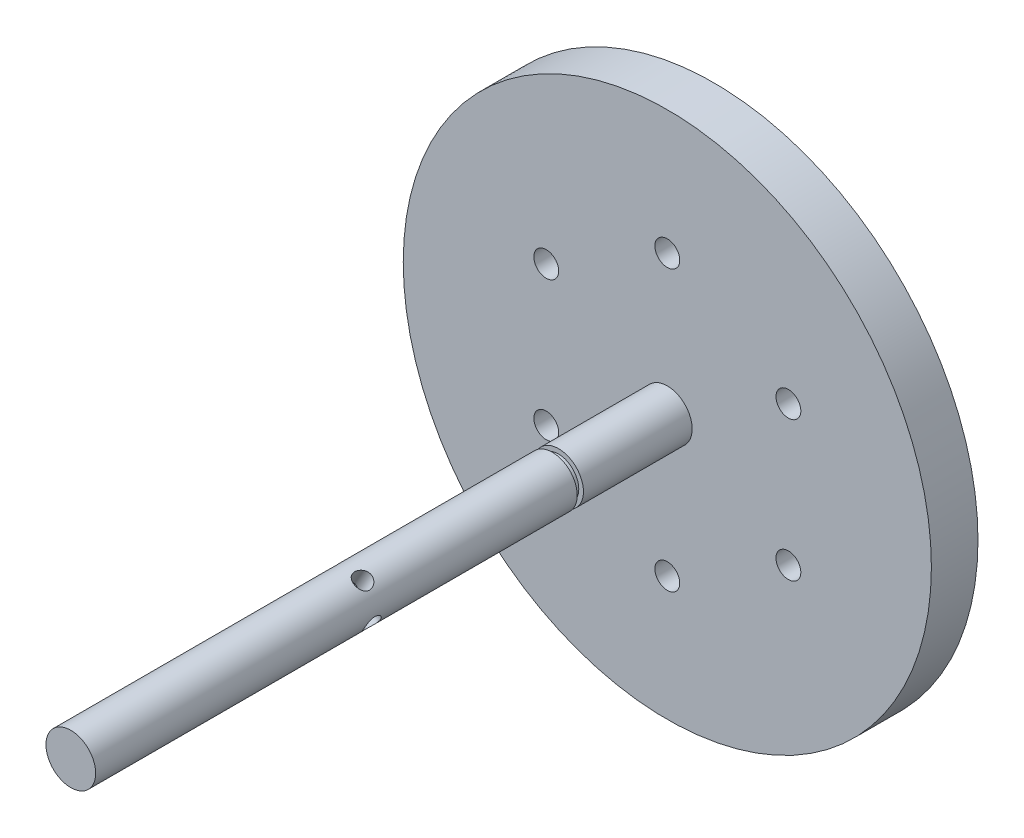
ISO-10303-21;
HEADER;
FILE_DESCRIPTION(('STEP AP214'),'2;1');
FILE_NAME('part.step','',(''),(''),'','','');
FILE_SCHEMA(('AUTOMOTIVE_DESIGN { 1 0 10303 214 1 1 1 1 }'));
ENDSEC;
DATA;
#1=APPLICATION_CONTEXT('core data for automotive mechanical design processes');
#2=APPLICATION_PROTOCOL_DEFINITION('international standard','automotive_design',2000,#1);
#3=PRODUCT_CONTEXT('',#1,'mechanical');
#4=PRODUCT('Part','Part','',(#3));
#5=PRODUCT_RELATED_PRODUCT_CATEGORY('part','',(#4));
#6=PRODUCT_DEFINITION_FORMATION('','',#4);
#7=PRODUCT_DEFINITION_CONTEXT('part definition',#1,'design');
#8=PRODUCT_DEFINITION('design','',#6,#7);
#9=PRODUCT_DEFINITION_SHAPE('','',#8);
#10=(LENGTH_UNIT() NAMED_UNIT(*) SI_UNIT(.MILLI.,.METRE.));
#11=(NAMED_UNIT(*) PLANE_ANGLE_UNIT() SI_UNIT($,.RADIAN.));
#12=(NAMED_UNIT(*) SI_UNIT($,.STERADIAN.) SOLID_ANGLE_UNIT());
#13=UNCERTAINTY_MEASURE_WITH_UNIT(LENGTH_MEASURE(1.E-05),#10,'distance_accuracy_value','');
#14=(GEOMETRIC_REPRESENTATION_CONTEXT(3) GLOBAL_UNCERTAINTY_ASSIGNED_CONTEXT((#13)) GLOBAL_UNIT_ASSIGNED_CONTEXT((#10,
#11,#12)) REPRESENTATION_CONTEXT('',''));
#15=CARTESIAN_POINT('',(0.,0.,0.));
#16=DIRECTION('',(0.,0.,1.));
#17=DIRECTION('',(1.,0.,0.));
#18=AXIS2_PLACEMENT_3D('',#15,#16,#17);
#19=CARTESIAN_POINT('',(-65.2404221471998,87.666575288732,125.));
#20=DIRECTION('',(0.866025403784436,-0.500000000000004,0.));
#21=DIRECTION('',(0.500000000000004,0.866025403784436,0.));
#22=AXIS2_PLACEMENT_3D('',#19,#20,#21);
#23=CYLINDRICAL_SURFACE('',#22,2.75);
#24=CARTESIAN_POINT('',(7.88100683983674,48.6253250600789,125.));
#25=CARTESIAN_POINT('',(7.88100648561913,48.625327263558,125.149484403382));
#26=CARTESIAN_POINT('',(7.87879816708141,48.6124787382199,125.298956836047));
#27=CARTESIAN_POINT('',(7.86970576134224,48.5618135604455,125.5934543314));
#28=CARTESIAN_POINT('',(7.86282114449435,48.5239940797649,125.738478888367));
#29=CARTESIAN_POINT('',(7.84367768935151,48.4254494960907,126.019762764748));
#30=CARTESIAN_POINT('',(7.83142992290832,48.3647716185397,126.156039482397));
#31=CARTESIAN_POINT('',(7.80052945349691,48.2232134268387,126.416862164568));
#32=CARTESIAN_POINT('',(7.78187520109731,48.1423282267669,126.541405281983));
#33=CARTESIAN_POINT('',(7.73613016940697,47.9600417326456,126.780411557589));
#34=CARTESIAN_POINT('',(7.70874700176705,47.8579802120958,126.894315348241));
#35=CARTESIAN_POINT('',(7.64453145820999,47.6390384949065,127.103771856066));
#36=CARTESIAN_POINT('',(7.60769745645135,47.5221557503007,127.199321410781));
#37=CARTESIAN_POINT('',(7.52240050554838,47.2739853759718,127.371932243864));
#38=CARTESIAN_POINT('',(7.47364132088044,47.142386454217,127.448402178024));
#39=CARTESIAN_POINT('',(7.36462496737484,46.872143339736,127.576759918411));
#40=CARTESIAN_POINT('',(7.30437111434425,46.7335011871754,127.628654798679));
#41=CARTESIAN_POINT('',(7.17528716552479,46.4591844592815,127.704477000997));
#42=CARTESIAN_POINT('',(7.10685451658792,46.3235885670117,127.729363701905));
#43=CARTESIAN_POINT('',(6.96125516040155,46.0548440003846,127.753519214448));
#44=CARTESIAN_POINT('',(6.88409084991422,45.9216946660775,127.752795039117));
#45=CARTESIAN_POINT('',(6.72681875857952,45.6674089670488,127.726345980131));
#46=CARTESIAN_POINT('',(6.64696768280106,45.5460032147195,127.701664302944));
#47=CARTESIAN_POINT('',(6.48424211619768,45.3122612160059,127.629733094545));
#48=CARTESIAN_POINT('',(6.40136741777984,45.1999255940576,127.582482011083));
#49=CARTESIAN_POINT('',(6.23459099626998,44.9851592873279,127.466175083569));
#50=CARTESIAN_POINT('',(6.15069057415261,44.8828834518391,127.396832440946));
#51=CARTESIAN_POINT('',(5.98635224571477,44.6915618097227,127.238550907588));
#52=CARTESIAN_POINT('',(5.90591535187251,44.6025198532973,127.149606332573));
#53=CARTESIAN_POINT('',(5.74807396823709,44.4346080120609,126.949442648805));
#54=CARTESIAN_POINT('',(5.67102074066502,44.3564668371762,126.837333929879));
#55=CARTESIAN_POINT('',(5.52840590609079,44.2166857063728,126.596677540203));
#56=CARTESIAN_POINT('',(5.46284631248555,44.1550486405656,126.468126996064));
#57=CARTESIAN_POINT('',(5.34608381507881,44.0480436334953,126.195531828109));
#58=CARTESIAN_POINT('',(5.29512752195165,44.0029519107676,126.051272124708));
#59=CARTESIAN_POINT('',(5.21255366601847,43.9310364856177,125.753002904486));
#60=CARTESIAN_POINT('',(5.18092737721183,43.9042045396984,125.59899782165));
#61=CARTESIAN_POINT('',(5.14046193439289,43.8700470626879,125.293465012907));
#62=CARTESIAN_POINT('',(5.13060931710043,43.8618534324852,125.142168582695));
#63=CARTESIAN_POINT('',(5.13142881389251,43.8625376866459,124.83968732206));
#64=CARTESIAN_POINT('',(5.14209688984122,43.8714122122761,124.688502475536));
#65=CARTESIAN_POINT('',(5.182352805878,43.9054236493333,124.396428820769));
#66=CARTESIAN_POINT('',(5.21121936607281,43.9299409998188,124.255366348858));
#67=CARTESIAN_POINT('',(5.28527268768449,43.9943124565737,123.981264334783));
#68=CARTESIAN_POINT('',(5.33046245585385,44.0341693884992,123.848226275996));
#69=CARTESIAN_POINT('',(5.43623589954173,44.1303665035653,123.589049192119));
#70=CARTESIAN_POINT('',(5.49728097372902,44.1872101449053,123.463286021029));
#71=CARTESIAN_POINT('',(5.63063559186262,44.3162915664434,123.226473898833));
#72=CARTESIAN_POINT('',(5.7029486555699,44.3885341593868,123.115429565548));
#73=CARTESIAN_POINT('',(5.85931356159089,44.5518943126784,122.905269956371));
#74=CARTESIAN_POINT('',(5.94377894621135,44.6437944312336,122.807067850351));
#75=CARTESIAN_POINT('',(6.11723513995591,44.8427884641403,122.632428643783));
#76=CARTESIAN_POINT('',(6.20622582091651,44.9498819483454,122.555990927239));
#77=CARTESIAN_POINT('',(6.38412500492079,45.1767666886991,122.427717385063));
#78=CARTESIAN_POINT('',(6.47303072486521,45.2964768805308,122.375734969586));
#79=CARTESIAN_POINT('',(6.64742376967013,45.546357952591,122.297652835897));
#80=CARTESIAN_POINT('',(6.73291240374444,45.6765247678323,122.271543111874));
#81=CARTESIAN_POINT('',(6.89300771432307,45.9369169428959,122.246892422876));
#82=CARTESIAN_POINT('',(6.9679442086175,46.0668170541246,122.247044218696));
#83=CARTESIAN_POINT('',(7.10947411599583,46.3288227942804,122.271654470638));
#84=CARTESIAN_POINT('',(7.17606827916538,46.4609282237083,122.296110739699));
#85=CARTESIAN_POINT('',(7.29846921326715,46.7208777263663,122.367753476998));
#86=CARTESIAN_POINT('',(7.35444677324784,46.8487558020766,122.414527954583));
#87=CARTESIAN_POINT('',(7.45665100750471,47.0988576819346,122.529091815702));
#88=CARTESIAN_POINT('',(7.50287588213125,47.2210804392714,122.596885072112));
#89=CARTESIAN_POINT('',(7.58744054510109,47.4608020453979,122.754547973205));
#90=CARTESIAN_POINT('',(7.62540983574835,47.5779398276893,122.845164720465));
#91=CARTESIAN_POINT('',(7.6920076517064,47.798563494324,123.04465482906));
#92=CARTESIAN_POINT('',(7.72063309341666,47.902044865163,123.153534199406));
#93=CARTESIAN_POINT('',(7.77075846327996,48.0958549037186,123.391966842931));
#94=CARTESIAN_POINT('',(7.79190515615227,48.1854406612915,123.522200533446));
#95=CARTESIAN_POINT('',(7.82674903315412,48.3421478839134,123.796467322612));
#96=CARTESIAN_POINT('',(7.84044756488314,48.4092734118569,123.940497919433));
#97=CARTESIAN_POINT('',(7.86142032404019,48.5164225362567,124.23483935916));
#98=CARTESIAN_POINT('',(7.86884144468728,48.5570604003382,124.384915139286));
#99=CARTESIAN_POINT('',(7.87863385833534,48.6115050585716,124.689999592243));
#100=CARTESIAN_POINT('',(7.88100720710933,48.6253227753888,124.845006230801));
#101=CARTESIAN_POINT('',(7.88100683983674,48.6253250600789,125.));
#102=B_SPLINE_CURVE_WITH_KNOTS('',3,(#24,#25,#26,#27,#28,#29,#30,#31,#32,#33,#34,#35,#36,#37,
#38,#39,#40,#41,#42,#43,#44,#45,#46,#47,#48,#49,#50,#51,#52,#53,#54,#55,#56,#57,#58,#59,#60,#61,
#62,#63,#64,#65,#66,#67,#68,#69,#70,#71,#72,#73,#74,#75,#76,#77,#78,#79,#80,#81,#82,#83,#84,#85,
#86,#87,#88,#89,#90,#91,#92,#93,#94,#95,#96,#97,#98,#99,#100,#101),.UNSPECIFIED.,.T.,.F.,(4,2,2,
2,2,2,2,2,2,2,2,2,2,2,2,2,2,2,2,2,2,2,2,2,2,2,2,2,2,2,2,2,2,2,2,2,2,2,4),(0.,0.447878471310559,
0.895807678647803,1.34281649487077,1.78993349798677,2.25396053342138,2.71806744972459,
3.19514524544689,3.67208562855214,4.13146570087796,4.59071998201178,5.03083403108972,
5.4709783541635,5.91708705064722,6.36332528288108,6.83181694416434,7.30039059163359,
7.77646484543835,8.25232402953415,8.70552141007255,9.15862961792376,9.59482010596747,
10.0310909817763,10.481850659322,10.9327514231396,11.4069565972228,11.8811483485421,
12.3524602995581,12.8235899076946,13.2712748436076,13.7189194978019,14.1586028223481,
14.5983672102306,15.0550012048507,15.5117857430623,15.9879212958433,16.4639706724929,
16.9285452993276,17.3929306856361),.UNSPECIFIED.);
#103=CARTESIAN_POINT('',(7.88100683983674,48.6253250600789,125.));
#104=VERTEX_POINT('',#103);
#105=EDGE_CURVE('E74',#104,#104,#102,.T.);
#106=ORIENTED_EDGE('',*,*,#105,.T.);
#107=EDGE_LOOP('',(#106));
#108=FACE_BOUND('',#107,.T.);
#109=CARTESIAN_POINT('',(1.94289029309402E-13,50.0000000000009,125.));
#110=DIRECTION('',(0.258819045102522,-0.965925826289068,0.));
#111=DIRECTION('',(0.965925826289068,0.258819045102522,0.));
#112=AXIS2_PLACEMENT_3D('',#109,#110,#111);
#113=ELLIPSE('',#112,3.88908729652599,2.75);
#114=CARTESIAN_POINT('',(1.94289029309402E-13,50.0000000000009,127.75));
#115=VERTEX_POINT('',#114);
#116=CARTESIAN_POINT('',(1.94289029309402E-13,50.0000000000009,122.25));
#117=VERTEX_POINT('',#116);
#118=EDGE_CURVE('E48',#115,#117,#113,.F.);
#119=ORIENTED_EDGE('',*,*,#118,.T.);
#120=CARTESIAN_POINT('',(1.94289029309402E-13,50.0000000000009,125.));
#121=DIRECTION('',(0.965925826289068,0.258819045102522,0.));
#122=DIRECTION('',(0.258819045102522,-0.965925826289068,0.));
#123=AXIS2_PLACEMENT_3D('',#120,#121,#122);
#124=ELLIPSE('',#123,3.88908729652603,2.75);
#125=EDGE_CURVE('E11',#117,#115,#124,.F.);
#126=ORIENTED_EDGE('',*,*,#125,.T.);
#127=EDGE_LOOP('',(#119,#126));
#128=FACE_BOUND('',#127,.T.);
#129=ADVANCED_FACE('F35',(#108,#128),#23,.F.);
#130=CARTESIAN_POINT('',(0.,50.,8.00000000000009));
#131=DIRECTION('',(0.,0.,1.));
#132=DIRECTION('',(1.,0.,0.));
#133=AXIS2_PLACEMENT_3D('',#130,#131,#132);
#134=CYLINDRICAL_SURFACE('',#133,85.0000000000001);
#135=CARTESIAN_POINT('',(0.,50.,8.00000000000008));
#136=DIRECTION('',(0.,0.,1.));
#137=DIRECTION('',(1.,0.,0.));
#138=AXIS2_PLACEMENT_3D('',#135,#136,#137);
#139=CIRCLE('',#138,85.0000000000001);
#140=CARTESIAN_POINT('',(85.0000000000001,50.,8.00000000000007));
#141=VERTEX_POINT('',#140);
#142=EDGE_CURVE('E61',#141,#141,#139,.T.);
#143=ORIENTED_EDGE('',*,*,#142,.T.);
#144=EDGE_LOOP('',(#143));
#145=FACE_BOUND('',#144,.T.);
#146=CARTESIAN_POINT('',(0.,50.,23.0000000000001));
#147=DIRECTION('',(0.,0.,1.));
#148=DIRECTION('',(1.,0.,0.));
#149=AXIS2_PLACEMENT_3D('',#146,#147,#148);
#150=CIRCLE('',#149,85.0000000000001);
#151=CARTESIAN_POINT('',(85.0000000000001,50.,23.0000000000001));
#152=VERTEX_POINT('',#151);
#153=EDGE_CURVE('E192',#152,#152,#150,.T.);
#154=ORIENTED_EDGE('',*,*,#153,.F.);
#155=EDGE_LOOP('',(#154));
#156=FACE_BOUND('',#155,.T.);
#157=ADVANCED_FACE('F37',(#145,#156),#134,.T.);
#158=CARTESIAN_POINT('',(85.0000000000001,50.,8.00000000000007));
#159=DIRECTION('',(0.,0.,-1.));
#160=DIRECTION('',(-1.,0.,0.));
#161=AXIS2_PLACEMENT_3D('',#158,#159,#160);
#162=PLANE('',#161);
#163=CARTESIAN_POINT('',(0.,50.,8.00000000000008));
#164=DIRECTION('',(0.,0.,-1.));
#165=DIRECTION('',(-1.,0.,0.));
#166=AXIS2_PLACEMENT_3D('',#163,#164,#165);
#167=CIRCLE('',#166,4.);
#168=CARTESIAN_POINT('',(-3.99999999999997,50.,8.00000000000008));
#169=VERTEX_POINT('',#168);
#170=EDGE_CURVE('E255',#169,#169,#167,.T.);
#171=ORIENTED_EDGE('',*,*,#170,.F.);
#172=EDGE_LOOP('',(#171));
#173=FACE_BOUND('',#172,.T.);
#174=CARTESIAN_POINT('',(0.,95.,8.00000000000008));
#175=DIRECTION('',(0.,0.,-1.));
#176=DIRECTION('',(-1.,0.,0.));
#177=AXIS2_PLACEMENT_3D('',#174,#175,#176);
#178=CIRCLE('',#177,4.);
#179=CARTESIAN_POINT('',(-3.99999999999998,95.,8.00000000000008));
#180=VERTEX_POINT('',#179);
#181=EDGE_CURVE('E73',#180,#180,#178,.T.);
#182=ORIENTED_EDGE('',*,*,#181,.F.);
#183=EDGE_LOOP('',(#182));
#184=FACE_BOUND('',#183,.T.);
#185=CARTESIAN_POINT('',(38.9711431702998,72.5,8.00000000000008));
#186=DIRECTION('',(0.,0.,-1.));
#187=DIRECTION('',(-1.,0.,0.));
#188=AXIS2_PLACEMENT_3D('',#185,#186,#187);
#189=CIRCLE('',#188,4.);
#190=CARTESIAN_POINT('',(34.9711431702998,72.5,8.00000000000008));
#191=VERTEX_POINT('',#190);
#192=EDGE_CURVE('E166',#191,#191,#189,.T.);
#193=ORIENTED_EDGE('',*,*,#192,.F.);
#194=EDGE_LOOP('',(#193));
#195=FACE_BOUND('',#194,.T.);
#196=CARTESIAN_POINT('',(38.9711431702997,27.4999999999999,8.00000000000008));
#197=DIRECTION('',(0.,0.,-1.));
#198=DIRECTION('',(-1.,0.,0.));
#199=AXIS2_PLACEMENT_3D('',#196,#197,#198);
#200=CIRCLE('',#199,4.);
#201=CARTESIAN_POINT('',(34.9711431702997,27.4999999999999,8.00000000000008));
#202=VERTEX_POINT('',#201);
#203=EDGE_CURVE('E170',#202,#202,#200,.T.);
#204=ORIENTED_EDGE('',*,*,#203,.F.);
#205=EDGE_LOOP('',(#204));
#206=FACE_BOUND('',#205,.T.);
#207=CARTESIAN_POINT('',(0.,5.,8.00000000000008));
#208=DIRECTION('',(0.,0.,-1.));
#209=DIRECTION('',(-1.,0.,0.));
#210=AXIS2_PLACEMENT_3D('',#207,#208,#209);
#211=CIRCLE('',#210,4.);
#212=CARTESIAN_POINT('',(-4.00000000000001,5.,8.00000000000008));
#213=VERTEX_POINT('',#212);
#214=EDGE_CURVE('E174',#213,#213,#211,.T.);
#215=ORIENTED_EDGE('',*,*,#214,.F.);
#216=EDGE_LOOP('',(#215));
#217=FACE_BOUND('',#216,.T.);
#218=CARTESIAN_POINT('',(-38.9711431702997,27.5,8.00000000000008));
#219=DIRECTION('',(0.,0.,-1.));
#220=DIRECTION('',(-1.,0.,0.));
#221=AXIS2_PLACEMENT_3D('',#218,#219,#220);
#222=CIRCLE('',#221,4.);
#223=CARTESIAN_POINT('',(-42.9711431702997,27.5,8.00000000000008));
#224=VERTEX_POINT('',#223);
#225=EDGE_CURVE('E180',#224,#224,#222,.T.);
#226=ORIENTED_EDGE('',*,*,#225,.F.);
#227=EDGE_LOOP('',(#226));
#228=FACE_BOUND('',#227,.T.);
#229=CARTESIAN_POINT('',(-38.9711431702997,72.4999999999999,8.00000000000008));
#230=DIRECTION('',(0.,0.,-1.));
#231=DIRECTION('',(-1.,0.,0.));
#232=AXIS2_PLACEMENT_3D('',#229,#230,#231);
#233=CIRCLE('',#232,4.);
#234=CARTESIAN_POINT('',(-42.9711431702997,72.4999999999999,8.00000000000008));
#235=VERTEX_POINT('',#234);
#236=EDGE_CURVE('E186',#235,#235,#233,.T.);
#237=ORIENTED_EDGE('',*,*,#236,.F.);
#238=EDGE_LOOP('',(#237));
#239=FACE_BOUND('',#238,.T.);
#240=ORIENTED_EDGE('',*,*,#142,.F.);
#241=EDGE_LOOP('',(#240));
#242=FACE_BOUND('',#241,.T.);
#243=ADVANCED_FACE('F143',(#173,#184,#195,#206,#217,#228,#239,#242),#162,.T.);
#244=CARTESIAN_POINT('',(0.,50.,215.));
#245=DIRECTION('',(0.,0.,1.));
#246=DIRECTION('',(1.,0.,0.));
#247=AXIS2_PLACEMENT_3D('',#244,#245,#246);
#248=PLANE('',#247);
#249=CARTESIAN_POINT('',(0.,50.,215.));
#250=DIRECTION('',(0.,0.,1.));
#251=DIRECTION('',(1.,0.,0.));
#252=AXIS2_PLACEMENT_3D('',#249,#250,#251);
#253=CIRCLE('',#252,8.);
#254=CARTESIAN_POINT('',(8.00000000000003,50.,215.));
#255=VERTEX_POINT('',#254);
#256=EDGE_CURVE('E209',#255,#255,#253,.T.);
#257=ORIENTED_EDGE('',*,*,#256,.T.);
#258=EDGE_LOOP('',(#257));
#259=FACE_BOUND('',#258,.T.);
#260=ADVANCED_FACE('F134',(#259),#248,.T.);
#261=CARTESIAN_POINT('',(0.,50.,8.00000000000009));
#262=DIRECTION('',(0.,0.,1.));
#263=DIRECTION('',(1.,0.,0.));
#264=AXIS2_PLACEMENT_3D('',#261,#262,#263);
#265=CYLINDRICAL_SURFACE('',#264,8.00000000000001);
#266=CARTESIAN_POINT('',(-6.13781466073653,44.8689931601637,125.));
#267=CARTESIAN_POINT('',(-6.13781545571463,44.8689952455414,124.850515596618));
#268=CARTESIAN_POINT('',(-6.12947873309229,44.8589722554662,124.701043163953));
#269=CARTESIAN_POINT('',(-6.09627188985346,44.8196411272959,124.4065456686));
#270=CARTESIAN_POINT('',(-6.07139989642759,44.7903308046926,124.261521111633));
#271=CARTESIAN_POINT('',(-6.00554888612054,44.7145604193968,123.980237235252));
#272=CARTESIAN_POINT('',(-5.96460307046563,44.6681357192115,123.843960517603));
#273=CARTESIAN_POINT('',(-5.86706338311595,44.5609929637903,123.583137835432));
#274=CARTESIAN_POINT('',(-5.8104657266134,44.5002714519378,123.458594718017));
#275=CARTESIAN_POINT('',(-5.67970612001196,44.365279233107,123.219588442411));
#276=CARTESIAN_POINT('',(-5.60496084092482,44.2905829473821,123.105684651759));
#277=CARTESIAN_POINT('',(-5.43987769029192,44.1330816301265,122.896228143934));
#278=CARTESIAN_POINT('',(-5.34953713674297,44.0502752049131,122.800678589219));
#279=CARTESIAN_POINT('',(-5.15158262323117,43.8780018317291,122.628067756136));
#280=CARTESIAN_POINT('',(-5.04355646976352,43.7884134147128,122.551597821976));
#281=CARTESIAN_POINT('',(-4.81402398095924,43.6088841891273,122.423240081589));
#282=CARTESIAN_POINT('',(-4.69252153727853,43.5189434894897,122.371345201321));
#283=CARTESIAN_POINT('',(-4.44357319443314,43.3459202088603,122.295522999003));
#284=CARTESIAN_POINT('',(-4.31651083587061,43.2627070459743,122.270636298095));
#285=CARTESIAN_POINT('',(-4.05604581132501,43.1027671022394,122.246480785552));
#286=CARTESIAN_POINT('',(-3.92264489102391,43.0260385514761,122.247204960883));
#287=CARTESIAN_POINT('',(-3.65930041510743,42.8844567219656,122.273654019869));
#288=CARTESIAN_POINT('',(-3.5294444787991,42.8192417941721,122.298335697056));
#289=CARTESIAN_POINT('',(-3.27164900491857,42.6981780686565,122.370266905455));
#290=CARTESIAN_POINT('',(-3.14370959978355,42.6423299155082,122.417517988917));
#291=CARTESIAN_POINT('',(-2.8918938286389,42.5397250487583,122.533824916431));
#292=CARTESIAN_POINT('',(-2.76809601395262,42.4931017880904,122.603167559054));
#293=CARTESIAN_POINT('',(-2.53011402565182,42.4095815499428,122.761449092412));
#294=CARTESIAN_POINT('',(-2.41593265397017,42.3726874005969,122.850393667427));
#295=CARTESIAN_POINT('',(-2.19528208535518,42.3061921723077,123.050557351195));
#296=CARTESIAN_POINT('',(-2.08948144539185,42.277046543562,123.162666070121));
#297=CARTESIAN_POINT('',(-1.89608281029235,42.2272999506037,123.403322459797));
#298=CARTESIAN_POINT('',(-1.80848800386481,42.2067004826025,123.531873003936));
#299=CARTESIAN_POINT('',(-1.65386621136608,42.1724126768509,123.804468171891));
#300=CARTESIAN_POINT('',(-1.58719090567145,42.1588402460319,123.948727875292));
#301=CARTESIAN_POINT('',(-1.47972213616993,42.1378465888947,124.246997095514));
#302=CARTESIAN_POINT('',(-1.43891699367627,42.1304225864989,124.40100217835));
#303=CARTESIAN_POINT('',(-1.38679415371443,42.1210740650881,124.706534987093));
#304=CARTESIAN_POINT('',(-1.37416472174409,42.1189044818296,124.857831417305));
#305=CARTESIAN_POINT('',(-1.37521655386469,42.1190873149194,125.16031267794));
#306=CARTESIAN_POINT('',(-1.38889264146086,42.1214388415873,125.311497524464));
#307=CARTESIAN_POINT('',(-1.44076100592993,42.1307656520797,125.603571179231));
#308=CARTESIAN_POINT('',(-1.47801885562125,42.1375650203362,125.744633651142));
#309=CARTESIAN_POINT('',(-1.57433664174903,42.1562856763587,126.018735665217));
#310=CARTESIAN_POINT('',(-1.63340059493757,42.1682079078384,126.151773724004));
#311=CARTESIAN_POINT('',(-1.77310164175009,42.1986303314125,126.410950807881));
#312=CARTESIAN_POINT('',(-1.85439004744219,42.2173358317629,126.536713978971));
#313=CARTESIAN_POINT('',(-2.03441924522695,42.2624463129047,126.773526101167));
#314=CARTESIAN_POINT('',(-2.13316549189462,42.2888537017753,126.884570434452));
#315=CARTESIAN_POINT('',(-2.35026154941495,42.3521452914814,127.094730043629));
#316=CARTESIAN_POINT('',(-2.46936077751429,42.3895004364508,127.192932149649));
#317=CARTESIAN_POINT('',(-2.7190752641942,42.4751062272772,127.367571356217));
#318=CARTESIAN_POINT('',(-2.84969019670872,42.5233565646983,127.444009072761));
#319=CARTESIAN_POINT('',(-3.11719777954578,42.6308949215734,127.572282614937));
#320=CARTESIAN_POINT('',(-3.25404748747527,42.6901141288194,127.624265030414));
#321=CARTESIAN_POINT('',(-3.53001683054979,42.819320962746,127.702347164103));
#322=CARTESIAN_POINT('',(-3.66913556701361,42.8893044144374,127.728456888126));
#323=CARTESIAN_POINT('',(-3.9379782605333,43.0347629976999,127.753107577124));
#324=CARTESIAN_POINT('',(-4.06782522387715,43.1097915468311,127.752955781304));
#325=CARTESIAN_POINT('',(-4.32139658914,43.2659302200543,127.728345529362));
#326=CARTESIAN_POINT('',(-4.44512154090255,43.3470397963319,127.703889260301));
#327=CARTESIAN_POINT('',(-4.68109861061065,43.5109622022839,127.632246523002));
#328=CARTESIAN_POINT('',(-4.79351563745094,43.5937190844458,127.585472045417));
#329=CARTESIAN_POINT('',(-5.00707804062074,43.7592115488086,127.470908184298));
#330=CARTESIAN_POINT('',(-5.10822133500246,43.8419471242696,127.403114927888));
#331=CARTESIAN_POINT('',(-5.30131728446006,44.0072697935261,127.245452026795));
#332=CARTESIAN_POINT('',(-5.39276854587001,44.0897294434099,127.154835279535));
#333=CARTESIAN_POINT('',(-5.5607557796436,44.2474962354126,126.95534517094));
#334=CARTESIAN_POINT('',(-5.63728682477873,44.3228010105224,126.846465800594));
#335=CARTESIAN_POINT('',(-5.77760168773224,44.4655827424884,126.608033157069));
#336=CARTESIAN_POINT('',(-5.84070813975214,44.5325929379276,126.477799466554));
#337=CARTESIAN_POINT('',(-5.94923743371303,44.6508834351737,126.203532677388));
#338=CARTESIAN_POINT('',(-5.99466347415667,44.7021665817508,126.059502080567));
#339=CARTESIAN_POINT('',(-6.06640097857404,44.7844740658957,125.76516064084));
#340=CARTESIAN_POINT('',(-6.09314678961972,44.8159569282222,125.615084860714));
#341=CARTESIAN_POINT('',(-6.12884959771996,44.8582111785287,125.310000407757));
#342=CARTESIAN_POINT('',(-6.13781383645889,44.8689909979278,125.154993769199));
#343=CARTESIAN_POINT('',(-6.13781466073653,44.8689931601637,125.));
#344=B_SPLINE_CURVE_WITH_KNOTS('',3,(#266,#267,#268,#269,#270,#271,#272,#273,#274,#275,#276,
#277,#278,#279,#280,#281,#282,#283,#284,#285,#286,#287,#288,#289,#290,#291,#292,#293,#294,#295,
#296,#297,#298,#299,#300,#301,#302,#303,#304,#305,#306,#307,#308,#309,#310,#311,#312,#313,#314,
#315,#316,#317,#318,#319,#320,#321,#322,#323,#324,#325,#326,#327,#328,#329,#330,#331,#332,#333,
#334,#335,#336,#337,#338,#339,#340,#341,#342,#343),.UNSPECIFIED.,.T.,.F.,(4,2,2,2,2,2,2,2,2,2,2,
2,2,2,2,2,2,2,2,2,2,2,2,2,2,2,2,2,2,2,2,2,2,2,2,2,2,2,4),(0.,0.447878471310574,
0.895807678647815,1.34281649487084,1.78993349798678,2.25396053342142,2.71806744972461,
3.19514524544692,3.67208562855215,4.13146570087795,4.59071998201176,5.0308340310897,
5.47097835416348,5.91708705064718,6.36332528288108,6.83181694416437,7.30039059163361,
7.77646484543839,8.2523240295342,8.70552141007249,9.15862961792376,9.59482010596746,
10.0310909817763,10.481850659322,10.9327514231395,11.4069565972227,11.8811483485421,
12.352460299558,12.8235899076947,13.2712748436077,13.7189194978019,14.1586028223481,
14.5983672102306,15.0550012048507,15.5117857430624,15.9879212958433,16.4639706724929,
16.9285452993276,17.3929306856361),.UNSPECIFIED.);
#345=CARTESIAN_POINT('',(-6.13781466073653,44.8689931601637,125.));
#346=VERTEX_POINT('',#345);
#347=EDGE_CURVE('E148',#346,#346,#344,.T.);
#348=ORIENTED_EDGE('',*,*,#347,.F.);
#349=EDGE_LOOP('',(#348));
#350=FACE_BOUND('',#349,.T.);
#351=CARTESIAN_POINT('',(1.37467493992165,57.8810068398367,125.));
#352=CARTESIAN_POINT('',(1.37467273644255,57.881006485619,125.149484403382));
#353=CARTESIAN_POINT('',(1.38752126178065,57.8787981670813,125.298956836047));
#354=CARTESIAN_POINT('',(1.43818643955504,57.8697057613421,125.5934543314));
#355=CARTESIAN_POINT('',(1.47600592023559,57.8628211444942,125.738478888367));
#356=CARTESIAN_POINT('',(1.57455050390984,57.8436776893514,126.019762764748));
#357=CARTESIAN_POINT('',(1.63522838146084,57.8314299229082,126.156039482397));
#358=CARTESIAN_POINT('',(1.77678657316188,57.8005294534968,126.416862164568));
#359=CARTESIAN_POINT('',(1.85767177323359,57.7818752010972,126.541405281983));
#360=CARTESIAN_POINT('',(2.03995826735495,57.7361301694068,126.780411557589));
#361=CARTESIAN_POINT('',(2.1420197879047,57.7087470017669,126.894315348241));
#362=CARTESIAN_POINT('',(2.36096150509401,57.6445314582098,127.103771856066));
#363=CARTESIAN_POINT('',(2.47784424969985,57.6076974564512,127.199321410781));
#364=CARTESIAN_POINT('',(2.72601462402876,57.5224005055482,127.371932243864));
#365=CARTESIAN_POINT('',(2.85761354578354,57.4736413208802,127.448402178024));
#366=CARTESIAN_POINT('',(3.12785666026448,57.3646249673746,127.576759918411));
#367=CARTESIAN_POINT('',(3.26649881282513,57.304371114344,127.628654798679));
#368=CARTESIAN_POINT('',(3.54081554071896,57.1752871655246,127.704477000997));
#369=CARTESIAN_POINT('',(3.67641143298881,57.1068545165877,127.729363701905));
#370=CARTESIAN_POINT('',(3.94515599961587,56.9612551604013,127.753519214448));
#371=CARTESIAN_POINT('',(4.07830533392298,56.884090849914,127.752795039117));
#372=CARTESIAN_POINT('',(4.33259103295159,56.7268187585793,127.726345980131));
#373=CARTESIAN_POINT('',(4.45399678528091,56.6469676828008,127.701664302944));
#374=CARTESIAN_POINT('',(4.68773878399447,56.4842421161974,127.629733094545));
#375=CARTESIAN_POINT('',(4.80007440594282,56.4013674177795,127.582482011083));
#376=CARTESIAN_POINT('',(5.01484071267252,56.2345909962697,127.466175083569));
#377=CARTESIAN_POINT('',(5.11711654816132,56.1506905741523,127.396832440946));
#378=CARTESIAN_POINT('',(5.30843819027762,55.9863522457144,127.238550907588));
#379=CARTESIAN_POINT('',(5.39748014670307,55.9059153518722,127.149606332573));
#380=CARTESIAN_POINT('',(5.56539198793947,55.7480739682367,126.949442648805));
#381=CARTESIAN_POINT('',(5.64353316282413,55.6710207406647,126.837333929879));
#382=CARTESIAN_POINT('',(5.78331429362752,55.5284059060904,126.596677540203));
#383=CARTESIAN_POINT('',(5.84495135943475,55.4628463124852,126.468126996064));
#384=CARTESIAN_POINT('',(5.9519563665051,55.3460838150784,126.195531828109));
#385=CARTESIAN_POINT('',(5.99704808923272,55.2951275219512,126.051272124708));
#386=CARTESIAN_POINT('',(6.06896351438261,55.2125536660181,125.753002904486));
#387=CARTESIAN_POINT('',(6.09579546030199,55.1809273772114,125.59899782165));
#388=CARTESIAN_POINT('',(6.12995293731251,55.1404619343925,125.293465012907));
#389=CARTESIAN_POINT('',(6.13814656751513,55.1306093171,125.142168582695));
#390=CARTESIAN_POINT('',(6.13746231335443,55.1314288138921,124.83968732206));
#391=CARTESIAN_POINT('',(6.12858778772426,55.1420968898408,124.688502475536));
#392=CARTESIAN_POINT('',(6.09457635066706,55.1823528058776,124.396428820769));
#393=CARTESIAN_POINT('',(6.07005900018158,55.2112193660724,124.255366348858));
#394=CARTESIAN_POINT('',(6.00568754342669,55.2852726876841,123.981264334783));
#395=CARTESIAN_POINT('',(5.96583061150121,55.3304624558534,123.848226275996));
#396=CARTESIAN_POINT('',(5.86963349643509,55.4362358995413,123.589049192119));
#397=CARTESIAN_POINT('',(5.8127898550951,55.4972809737286,123.46328602103));
#398=CARTESIAN_POINT('',(5.68370843355695,55.6306355918622,123.226473898833));
#399=CARTESIAN_POINT('',(5.61146584061359,55.7029486555695,123.115429565548));
#400=CARTESIAN_POINT('',(5.44810568732201,55.8593135615905,122.905269956371));
#401=CARTESIAN_POINT('',(5.35620556876681,55.943778946211,122.807067850351));
#402=CARTESIAN_POINT('',(5.15721153586011,56.1172351399556,122.632428643783));
#403=CARTESIAN_POINT('',(5.05011805165501,56.2062258209162,122.555990927239));
#404=CARTESIAN_POINT('',(4.82323331130138,56.3841250049205,122.427717385063));
#405=CARTESIAN_POINT('',(4.70352311946963,56.4730307248649,122.375734969586));
#406=CARTESIAN_POINT('',(4.45364204740942,56.6474237696698,122.297652835897));
#407=CARTESIAN_POINT('',(4.32347523216817,56.7329124037442,122.271543111874));
#408=CARTESIAN_POINT('',(4.06308305710453,56.8930077143228,122.246892422876));
#409=CARTESIAN_POINT('',(3.93318294587589,56.9679442086172,122.247044218696));
#410=CARTESIAN_POINT('',(3.67117720572002,57.1094741159956,122.271654470638));
#411=CARTESIAN_POINT('',(3.53907177629216,57.1760682791651,122.296110739699));
#412=CARTESIAN_POINT('',(3.27912227363415,57.2984692132669,122.367753476998));
#413=CARTESIAN_POINT('',(3.15124419792388,57.3544467732476,122.414527954583));
#414=CARTESIAN_POINT('',(2.90114231806588,57.4566510075045,122.529091815702));
#415=CARTESIAN_POINT('',(2.77891956072908,57.5028758821311,122.596885072112));
#416=CARTESIAN_POINT('',(2.53919795460262,57.5874405451009,122.754547973205));
#417=CARTESIAN_POINT('',(2.42206017231115,57.6254098357482,122.845164720465));
#418=CARTESIAN_POINT('',(2.20143650567647,57.6920076517062,123.04465482906));
#419=CARTESIAN_POINT('',(2.09795513483748,57.7206330934165,123.153534199406));
#420=CARTESIAN_POINT('',(1.9041450962819,57.7707584632798,123.391966842931));
#421=CARTESIAN_POINT('',(1.814559338709,57.7919051561521,123.522200533446));
#422=CARTESIAN_POINT('',(1.65785211608714,57.826749033154,123.796467322612));
#423=CARTESIAN_POINT('',(1.5907265881436,57.840447564883,123.940497919433));
#424=CARTESIAN_POINT('',(1.4835774637438,57.8614203240401,124.23483935916));
#425=CARTESIAN_POINT('',(1.4429395996623,57.8688414446872,124.384915139286));
#426=CARTESIAN_POINT('',(1.38849494142896,57.8786338583352,124.689999592243));
#427=CARTESIAN_POINT('',(1.37467722461172,57.8810072071092,124.845006230801));
#428=CARTESIAN_POINT('',(1.37467493992165,57.8810068398367,125.));
#429=B_SPLINE_CURVE_WITH_KNOTS('',3,(#351,#352,#353,#354,#355,#356,#357,#358,#359,#360,#361,
#362,#363,#364,#365,#366,#367,#368,#369,#370,#371,#372,#373,#374,#375,#376,#377,#378,#379,#380,
#381,#382,#383,#384,#385,#386,#387,#388,#389,#390,#391,#392,#393,#394,#395,#396,#397,#398,#399,
#400,#401,#402,#403,#404,#405,#406,#407,#408,#409,#410,#411,#412,#413,#414,#415,#416,#417,#418,
#419,#420,#421,#422,#423,#424,#425,#426,#427,#428),.UNSPECIFIED.,.T.,.F.,(4,2,2,2,2,2,2,2,2,2,2,
2,2,2,2,2,2,2,2,2,2,2,2,2,2,2,2,2,2,2,2,2,2,2,2,2,2,2,4),(0.,0.447878471310558,
0.895807678647801,1.34281649487083,1.78993349798676,2.25396053342142,2.71806744972462,
3.19514524544692,3.67208562855217,4.13146570087796,4.59071998201176,5.0308340310897,
5.47097835416346,5.91708705064717,6.36332528288108,6.83181694416435,7.30039059163359,
7.77646484543836,8.25232402953419,8.70552141007257,9.15862961792376,9.59482010596745,
10.0310909817763,10.481850659322,10.9327514231395,11.4069565972227,11.8811483485421,
12.3524602995581,12.8235899076947,13.2712748436077,13.7189194978019,14.1586028223481,
14.5983672102306,15.0550012048507,15.5117857430624,15.9879212958433,16.4639706724929,
16.9285452993276,17.3929306856361),.UNSPECIFIED.);
#430=CARTESIAN_POINT('',(1.37467493992165,57.8810068398367,125.));
#431=VERTEX_POINT('',#430);
#432=EDGE_CURVE('E150',#431,#431,#429,.T.);
#433=ORIENTED_EDGE('',*,*,#432,.F.);
#434=EDGE_LOOP('',(#433));
#435=FACE_BOUND('',#434,.T.);
#436=CARTESIAN_POINT('',(-5.13100683983579,56.137814660737,125.));
#437=CARTESIAN_POINT('',(-5.13100475445811,56.1378154557151,124.850515596618));
#438=CARTESIAN_POINT('',(-5.14102774453324,56.1294787330927,124.701043163953));
#439=CARTESIAN_POINT('',(-5.18035887270355,56.0962718898539,124.4065456686));
#440=CARTESIAN_POINT('',(-5.20966919530689,56.071399896428,124.261521111633));
#441=CARTESIAN_POINT('',(-5.28543958060273,56.005548886121,123.980237235252));
#442=CARTESIAN_POINT('',(-5.33186428078803,55.9646030704661,123.843960517603));
#443=CARTESIAN_POINT('',(-5.43900703620922,55.8670633831164,123.583137835432));
#444=CARTESIAN_POINT('',(-5.49972854806171,55.8104657266139,123.458594718017));
#445=CARTESIAN_POINT('',(-5.63472076689244,55.6797061200125,123.219588442411));
#446=CARTESIAN_POINT('',(-5.70941705261743,55.6049608409253,123.105684651759));
#447=CARTESIAN_POINT('',(-5.86691836987303,55.4398776902925,122.896228143934));
#448=CARTESIAN_POINT('',(-5.94972479508642,55.3495371367435,122.800678589219));
#449=CARTESIAN_POINT('',(-6.12199816827047,55.1515826232317,122.628067756136));
#450=CARTESIAN_POINT('',(-6.21158658528678,55.0435564697641,122.551597821976));
#451=CARTESIAN_POINT('',(-6.39111581087231,54.8140239809598,122.423240081589));
#452=CARTESIAN_POINT('',(-6.48105651050991,54.6925215372791,122.371345201321));
#453=CARTESIAN_POINT('',(-6.65407979113927,54.4435731944337,122.295522999003));
#454=CARTESIAN_POINT('',(-6.73729295402535,54.3165108358712,122.270636298095));
#455=CARTESIAN_POINT('',(-6.89723289776026,54.0560458113256,122.246480785552));
#456=CARTESIAN_POINT('',(-6.97396144852355,53.9226448910245,122.247204960883));
#457=CARTESIAN_POINT('',(-7.11554327803408,53.659300415108,122.273654019869));
#458=CARTESIAN_POINT('',(-7.18075820582761,53.5294444787997,122.298335697056));
#459=CARTESIAN_POINT('',(-7.30182193134322,53.2716490049192,122.370266905455));
#460=CARTESIAN_POINT('',(-7.3576700844915,53.1437095997842,122.417517988917));
#461=CARTESIAN_POINT('',(-7.46027495124146,52.8918938286395,122.533824916431));
#462=CARTESIAN_POINT('',(-7.50689821190936,52.7680960139533,122.603167559054));
#463=CARTESIAN_POINT('',(-7.59041845005692,52.5301140256525,122.761449092412));
#464=CARTESIAN_POINT('',(-7.6273125994029,52.4159326539708,122.850393667427));
#465=CARTESIAN_POINT('',(-7.69380782769213,52.1952820853559,123.050557351195));
#466=CARTESIAN_POINT('',(-7.72295345643778,52.0894814453925,123.162666070121));
#467=CARTESIAN_POINT('',(-7.77270004939613,51.896082810293,123.403322459797));
#468=CARTESIAN_POINT('',(-7.7932995173973,51.8084880038655,123.531873003936));
#469=CARTESIAN_POINT('',(-7.82758732314899,51.6538662113668,123.804468171891));
#470=CARTESIAN_POINT('',(-7.84115975396794,51.5871909056722,123.948727875292));
#471=CARTESIAN_POINT('',(-7.86215341110511,51.4797221361706,124.246997095514));
#472=CARTESIAN_POINT('',(-7.86957741350095,51.438916993677,124.40100217835));
#473=CARTESIAN_POINT('',(-7.87892593491178,51.3867941537151,124.706534987093));
#474=CARTESIAN_POINT('',(-7.88109551817023,51.3741647217448,124.857831417305));
#475=CARTESIAN_POINT('',(-7.88091268508046,51.3752165538654,125.16031267794));
#476=CARTESIAN_POINT('',(-7.87856115841256,51.3888926414615,125.311497524464));
#477=CARTESIAN_POINT('',(-7.8692343479202,51.4407610059306,125.603571179231));
#478=CARTESIAN_POINT('',(-7.86243497966369,51.4780188556219,125.744633651142));
#479=CARTESIAN_POINT('',(-7.84371432364116,51.5743366417497,126.018735665217));
#480=CARTESIAN_POINT('',(-7.83179209216147,51.6334005949382,126.151773724004));
#481=CARTESIAN_POINT('',(-7.80136966858737,51.7731016417508,126.410950807881));
#482=CARTESIAN_POINT('',(-7.78266416823697,51.8543900474429,126.536713978971));
#483=CARTESIAN_POINT('',(-7.73755368709511,52.0344192452276,126.773526101167));
#484=CARTESIAN_POINT('',(-7.71114629822454,52.1331654918953,126.884570434452));
#485=CARTESIAN_POINT('',(-7.64785470851839,52.3502615494156,127.094730043629));
#486=CARTESIAN_POINT('',(-7.61049956354901,52.469360777515,127.192932149649));
#487=CARTESIAN_POINT('',(-7.52489377272256,52.7190752641949,127.367571356217));
#488=CARTESIAN_POINT('',(-7.47664343530145,52.8496901967094,127.444009072761));
#489=CARTESIAN_POINT('',(-7.36910507842631,53.1171977795464,127.572282614937));
#490=CARTESIAN_POINT('',(-7.30988587118031,53.2540474874759,127.624265030414));
#491=CARTESIAN_POINT('',(-7.18067903725373,53.5300168305504,127.702347164103));
#492=CARTESIAN_POINT('',(-7.11069558556225,53.6691355670142,127.728456888126));
#493=CARTESIAN_POINT('',(-6.96523700229976,53.9379782605339,127.753107577124));
#494=CARTESIAN_POINT('',(-6.89020845316854,54.0678252238777,127.752955781304));
#495=CARTESIAN_POINT('',(-6.73406977994537,54.3213965891406,127.728345529362));
#496=CARTESIAN_POINT('',(-6.65296020366776,54.4451215409031,127.703889260301));
#497=CARTESIAN_POINT('',(-6.48903779771567,54.6810986106112,127.632246523002));
#498=CARTESIAN_POINT('',(-6.40628091555385,54.7935156374515,127.585472045417));
#499=CARTESIAN_POINT('',(-6.240788451191,55.0070780406213,127.470908184298));
#500=CARTESIAN_POINT('',(-6.15805287573003,55.108221335003,127.403114927888));
#501=CARTESIAN_POINT('',(-5.99273020647342,55.3013172844606,127.245452026795));
#502=CARTESIAN_POINT('',(-5.91027055658965,55.3927685458705,127.154835279535));
#503=CARTESIAN_POINT('',(-5.75250376458697,55.5607557796441,126.95534517094));
#504=CARTESIAN_POINT('',(-5.67719898947709,55.6372868247792,126.846465800594));
#505=CARTESIAN_POINT('',(-5.53441725751116,55.7776016877327,126.608033157069));
#506=CARTESIAN_POINT('',(-5.46740706207191,55.8407081397526,126.477799466554));
#507=CARTESIAN_POINT('',(-5.34911656482578,55.9492374337135,126.203532677388));
#508=CARTESIAN_POINT('',(-5.29783341824874,55.9946634741571,126.059502080567));
#509=CARTESIAN_POINT('',(-5.21552593410378,56.0664009785745,125.76516064084));
#510=CARTESIAN_POINT('',(-5.18404307177721,56.0931467896202,125.615084860714));
#511=CARTESIAN_POINT('',(-5.14178882147079,56.1288495977204,125.310000407757));
#512=CARTESIAN_POINT('',(-5.13100900207173,56.1378138364594,125.154993769199));
#513=CARTESIAN_POINT('',(-5.13100683983579,56.137814660737,125.));
#514=B_SPLINE_CURVE_WITH_KNOTS('',3,(#436,#437,#438,#439,#440,#441,#442,#443,#444,#445,#446,
#447,#448,#449,#450,#451,#452,#453,#454,#455,#456,#457,#458,#459,#460,#461,#462,#463,#464,#465,
#466,#467,#468,#469,#470,#471,#472,#473,#474,#475,#476,#477,#478,#479,#480,#481,#482,#483,#484,
#485,#486,#487,#488,#489,#490,#491,#492,#493,#494,#495,#496,#497,#498,#499,#500,#501,#502,#503,
#504,#505,#506,#507,#508,#509,#510,#511,#512,#513),.UNSPECIFIED.,.T.,.F.,(4,2,2,2,2,2,2,2,2,2,2,
2,2,2,2,2,2,2,2,2,2,2,2,2,2,2,2,2,2,2,2,2,2,2,2,2,2,2,4),(0.,0.447878471310574,
0.895807678647801,1.34281649487085,1.78993349798674,2.25396053342137,2.71806744972458,
3.19514524544688,3.67208562855214,4.13146570087795,4.59071998201176,5.03083403108971,
5.47097835416348,5.91708705064717,6.36332528288107,6.83181694416433,7.30039059163357,
7.77646484543835,8.25232402953414,8.70552141007248,9.15862961792372,9.59482010596739,
10.0310909817762,10.481850659322,10.9327514231395,11.4069565972227,11.8811483485421,
12.352460299558,12.8235899076946,13.2712748436076,13.7189194978019,14.1586028223481,
14.5983672102305,15.0550012048507,15.5117857430623,15.9879212958433,16.4639706724929,
16.9285452993276,17.3929306856361),.UNSPECIFIED.);
#515=CARTESIAN_POINT('',(-5.13100683983579,56.137814660737,125.));
#516=VERTEX_POINT('',#515);
#517=EDGE_CURVE('E66',#516,#516,#514,.T.);
#518=ORIENTED_EDGE('',*,*,#517,.F.);
#519=EDGE_LOOP('',(#518));
#520=FACE_BOUND('',#519,.T.);
#521=ORIENTED_EDGE('',*,*,#105,.F.);
#522=EDGE_LOOP('',(#521));
#523=FACE_BOUND('',#522,.T.);
#524=CARTESIAN_POINT('',(0.,50.,60.));
#525=DIRECTION('',(0.,0.,1.));
#526=DIRECTION('',(1.,0.,0.));
#527=AXIS2_PLACEMENT_3D('',#524,#525,#526);
#528=CIRCLE('',#527,8.00000000000002);
#529=CARTESIAN_POINT('',(8.00000000000002,50.,60.));
#530=VERTEX_POINT('',#529);
#531=EDGE_CURVE('E206',#530,#530,#528,.T.);
#532=ORIENTED_EDGE('',*,*,#531,.T.);
#533=EDGE_LOOP('',(#532));
#534=FACE_BOUND('',#533,.T.);
#535=ORIENTED_EDGE('',*,*,#256,.F.);
#536=EDGE_LOOP('',(#535));
#537=FACE_BOUND('',#536,.T.);
#538=ADVANCED_FACE('F78',(#350,#435,#520,#523,#534,#537),#265,.T.);
#539=CARTESIAN_POINT('',(8.00000000000002,50.,60.));
#540=DIRECTION('',(0.,0.,-1.));
#541=DIRECTION('',(-1.,0.,0.));
#542=AXIS2_PLACEMENT_3D('',#539,#540,#541);
#543=PLANE('',#542);
#544=CARTESIAN_POINT('',(0.,50.,60.));
#545=DIRECTION('',(0.,0.,1.));
#546=DIRECTION('',(1.,0.,0.));
#547=AXIS2_PLACEMENT_3D('',#544,#545,#546);
#548=CIRCLE('',#547,6.50000000000011);
#549=CARTESIAN_POINT('',(6.50000000000012,50.,60.));
#550=VERTEX_POINT('',#549);
#551=EDGE_CURVE('E204',#550,#550,#548,.T.);
#552=ORIENTED_EDGE('',*,*,#551,.T.);
#553=EDGE_LOOP('',(#552));
#554=FACE_BOUND('',#553,.T.);
#555=ORIENTED_EDGE('',*,*,#531,.F.);
#556=EDGE_LOOP('',(#555));
#557=FACE_BOUND('',#556,.T.);
#558=ADVANCED_FACE('F127',(#554,#557),#543,.T.);
#559=CARTESIAN_POINT('',(0.,50.,8.00000000000009));
#560=DIRECTION('',(0.,0.,1.));
#561=DIRECTION('',(1.,0.,0.));
#562=AXIS2_PLACEMENT_3D('',#559,#560,#561);
#563=CYLINDRICAL_SURFACE('',#562,6.50000000000011);
#564=CARTESIAN_POINT('',(0.,50.,58.0000000000001));
#565=DIRECTION('',(0.,0.,1.));
#566=DIRECTION('',(1.,0.,0.));
#567=AXIS2_PLACEMENT_3D('',#564,#565,#566);
#568=CIRCLE('',#567,6.50000000000011);
#569=CARTESIAN_POINT('',(6.50000000000012,50.,58.0000000000001));
#570=VERTEX_POINT('',#569);
#571=EDGE_CURVE('E201',#570,#570,#568,.T.);
#572=ORIENTED_EDGE('',*,*,#571,.T.);
#573=EDGE_LOOP('',(#572));
#574=FACE_BOUND('',#573,.T.);
#575=ORIENTED_EDGE('',*,*,#551,.F.);
#576=EDGE_LOOP('',(#575));
#577=FACE_BOUND('',#576,.T.);
#578=ADVANCED_FACE('F124',(#574,#577),#563,.T.);
#579=CARTESIAN_POINT('',(6.50000000000012,50.,58.0000000000001));
#580=DIRECTION('',(0.,0.,1.));
#581=DIRECTION('',(1.,0.,0.));
#582=AXIS2_PLACEMENT_3D('',#579,#580,#581);
#583=PLANE('',#582);
#584=CARTESIAN_POINT('',(0.,50.,58.0000000000001));
#585=DIRECTION('',(0.,0.,1.));
#586=DIRECTION('',(1.,0.,0.));
#587=AXIS2_PLACEMENT_3D('',#584,#585,#586);
#588=CIRCLE('',#587,8.00000000000002);
#589=CARTESIAN_POINT('',(8.00000000000002,50.,58.0000000000001));
#590=VERTEX_POINT('',#589);
#591=EDGE_CURVE('E198',#590,#590,#588,.T.);
#592=ORIENTED_EDGE('',*,*,#591,.T.);
#593=EDGE_LOOP('',(#592));
#594=FACE_BOUND('',#593,.T.);
#595=ORIENTED_EDGE('',*,*,#571,.F.);
#596=EDGE_LOOP('',(#595));
#597=FACE_BOUND('',#596,.T.);
#598=ADVANCED_FACE('F120',(#594,#597),#583,.T.);
#599=CARTESIAN_POINT('',(0.,50.,8.00000000000009));
#600=DIRECTION('',(0.,0.,1.));
#601=DIRECTION('',(1.,0.,0.));
#602=AXIS2_PLACEMENT_3D('',#599,#600,#601);
#603=CYLINDRICAL_SURFACE('',#602,8.00000000000002);
#604=CARTESIAN_POINT('',(0.,50.,23.0000000000001));
#605=DIRECTION('',(0.,0.,1.));
#606=DIRECTION('',(1.,0.,0.));
#607=AXIS2_PLACEMENT_3D('',#604,#605,#606);
#608=CIRCLE('',#607,8.00000000000002);
#609=CARTESIAN_POINT('',(8.00000000000002,50.,23.0000000000001));
#610=VERTEX_POINT('',#609);
#611=EDGE_CURVE('E195',#610,#610,#608,.T.);
#612=ORIENTED_EDGE('',*,*,#611,.T.);
#613=EDGE_LOOP('',(#612));
#614=FACE_BOUND('',#613,.T.);
#615=ORIENTED_EDGE('',*,*,#591,.F.);
#616=EDGE_LOOP('',(#615));
#617=FACE_BOUND('',#616,.T.);
#618=ADVANCED_FACE('F116',(#614,#617),#603,.T.);
#619=CARTESIAN_POINT('',(8.00000000000002,50.,23.0000000000001));
#620=DIRECTION('',(0.,0.,1.));
#621=DIRECTION('',(1.,0.,0.));
#622=AXIS2_PLACEMENT_3D('',#619,#620,#621);
#623=PLANE('',#622);
#624=CARTESIAN_POINT('',(0.,95.,23.0000000000001));
#625=DIRECTION('',(0.,0.,1.));
#626=DIRECTION('',(1.,0.,0.));
#627=AXIS2_PLACEMENT_3D('',#624,#625,#626);
#628=CIRCLE('',#627,4.);
#629=CARTESIAN_POINT('',(4.00000000000001,95.,23.0000000000001));
#630=VERTEX_POINT('',#629);
#631=EDGE_CURVE('E165',#630,#630,#628,.T.);
#632=ORIENTED_EDGE('',*,*,#631,.F.);
#633=EDGE_LOOP('',(#632));
#634=FACE_BOUND('',#633,.T.);
#635=CARTESIAN_POINT('',(38.9711431702998,72.5,23.0000000000001));
#636=DIRECTION('',(0.,0.,1.));
#637=DIRECTION('',(1.,0.,0.));
#638=AXIS2_PLACEMENT_3D('',#635,#636,#637);
#639=CIRCLE('',#638,4.);
#640=CARTESIAN_POINT('',(42.9711431702998,72.5,23.0000000000001));
#641=VERTEX_POINT('',#640);
#642=EDGE_CURVE('E169',#641,#641,#639,.T.);
#643=ORIENTED_EDGE('',*,*,#642,.F.);
#644=EDGE_LOOP('',(#643));
#645=FACE_BOUND('',#644,.T.);
#646=CARTESIAN_POINT('',(38.9711431702997,27.4999999999999,23.0000000000001));
#647=DIRECTION('',(0.,0.,1.));
#648=DIRECTION('',(1.,0.,0.));
#649=AXIS2_PLACEMENT_3D('',#646,#647,#648);
#650=CIRCLE('',#649,4.);
#651=CARTESIAN_POINT('',(42.9711431702997,27.4999999999999,23.0000000000001));
#652=VERTEX_POINT('',#651);
#653=EDGE_CURVE('E173',#652,#652,#650,.T.);
#654=ORIENTED_EDGE('',*,*,#653,.F.);
#655=EDGE_LOOP('',(#654));
#656=FACE_BOUND('',#655,.T.);
#657=CARTESIAN_POINT('',(0.,5.,23.0000000000001));
#658=DIRECTION('',(0.,0.,1.));
#659=DIRECTION('',(1.,0.,0.));
#660=AXIS2_PLACEMENT_3D('',#657,#658,#659);
#661=CIRCLE('',#660,4.);
#662=CARTESIAN_POINT('',(3.99999999999999,5.,23.0000000000001));
#663=VERTEX_POINT('',#662);
#664=EDGE_CURVE('E177',#663,#663,#661,.T.);
#665=ORIENTED_EDGE('',*,*,#664,.F.);
#666=EDGE_LOOP('',(#665));
#667=FACE_BOUND('',#666,.T.);
#668=CARTESIAN_POINT('',(-38.9711431702997,27.5,23.0000000000001));
#669=DIRECTION('',(0.,0.,1.));
#670=DIRECTION('',(1.,0.,0.));
#671=AXIS2_PLACEMENT_3D('',#668,#669,#670);
#672=CIRCLE('',#671,4.);
#673=CARTESIAN_POINT('',(-34.9711431702997,27.5,23.0000000000001));
#674=VERTEX_POINT('',#673);
#675=EDGE_CURVE('E183',#674,#674,#672,.T.);
#676=ORIENTED_EDGE('',*,*,#675,.F.);
#677=EDGE_LOOP('',(#676));
#678=FACE_BOUND('',#677,.T.);
#679=CARTESIAN_POINT('',(-38.9711431702997,72.4999999999999,23.0000000000001));
#680=DIRECTION('',(0.,0.,1.));
#681=DIRECTION('',(1.,0.,0.));
#682=AXIS2_PLACEMENT_3D('',#679,#680,#681);
#683=CIRCLE('',#682,4.);
#684=CARTESIAN_POINT('',(-34.9711431702997,72.4999999999999,23.0000000000001));
#685=VERTEX_POINT('',#684);
#686=EDGE_CURVE('E189',#685,#685,#683,.T.);
#687=ORIENTED_EDGE('',*,*,#686,.F.);
#688=EDGE_LOOP('',(#687));
#689=FACE_BOUND('',#688,.T.);
#690=ORIENTED_EDGE('',*,*,#153,.T.);
#691=EDGE_LOOP('',(#690));
#692=FACE_BOUND('',#691,.T.);
#693=ORIENTED_EDGE('',*,*,#611,.F.);
#694=EDGE_LOOP('',(#693));
#695=FACE_BOUND('',#694,.T.);
#696=ADVANCED_FACE('F112',(#634,#645,#656,#667,#678,#689,#692,#695),#623,.T.);
#697=CARTESIAN_POINT('',(-38.9711431702997,72.4999999999999,8.00000000000008));
#698=DIRECTION('',(0.,0.,-1.));
#699=DIRECTION('',(-1.,0.,0.));
#700=AXIS2_PLACEMENT_3D('',#697,#698,#699);
#701=CYLINDRICAL_SURFACE('',#700,4.);
#702=ORIENTED_EDGE('',*,*,#686,.T.);
#703=EDGE_LOOP('',(#702));
#704=FACE_BOUND('',#703,.T.);
#705=ORIENTED_EDGE('',*,*,#236,.T.);
#706=EDGE_LOOP('',(#705));
#707=FACE_BOUND('',#706,.T.);
#708=ADVANCED_FACE('F108',(#704,#707),#701,.F.);
#709=CARTESIAN_POINT('',(-38.9711431702997,27.5,8.00000000000008));
#710=DIRECTION('',(0.,0.,-1.));
#711=DIRECTION('',(-1.,0.,0.));
#712=AXIS2_PLACEMENT_3D('',#709,#710,#711);
#713=CYLINDRICAL_SURFACE('',#712,4.);
#714=ORIENTED_EDGE('',*,*,#675,.T.);
#715=EDGE_LOOP('',(#714));
#716=FACE_BOUND('',#715,.T.);
#717=ORIENTED_EDGE('',*,*,#225,.T.);
#718=EDGE_LOOP('',(#717));
#719=FACE_BOUND('',#718,.T.);
#720=ADVANCED_FACE('F104',(#716,#719),#713,.F.);
#721=CARTESIAN_POINT('',(0.,5.,8.00000000000008));
#722=DIRECTION('',(0.,0.,-1.));
#723=DIRECTION('',(-1.,0.,0.));
#724=AXIS2_PLACEMENT_3D('',#721,#722,#723);
#725=CYLINDRICAL_SURFACE('',#724,4.);
#726=ORIENTED_EDGE('',*,*,#664,.T.);
#727=EDGE_LOOP('',(#726));
#728=FACE_BOUND('',#727,.T.);
#729=ORIENTED_EDGE('',*,*,#214,.T.);
#730=EDGE_LOOP('',(#729));
#731=FACE_BOUND('',#730,.T.);
#732=ADVANCED_FACE('F100',(#728,#731),#725,.F.);
#733=CARTESIAN_POINT('',(38.9711431702997,27.4999999999999,8.00000000000008));
#734=DIRECTION('',(0.,0.,-1.));
#735=DIRECTION('',(-1.,0.,0.));
#736=AXIS2_PLACEMENT_3D('',#733,#734,#735);
#737=CYLINDRICAL_SURFACE('',#736,4.);
#738=ORIENTED_EDGE('',*,*,#653,.T.);
#739=EDGE_LOOP('',(#738));
#740=FACE_BOUND('',#739,.T.);
#741=ORIENTED_EDGE('',*,*,#203,.T.);
#742=EDGE_LOOP('',(#741));
#743=FACE_BOUND('',#742,.T.);
#744=ADVANCED_FACE('F96',(#740,#743),#737,.F.);
#745=CARTESIAN_POINT('',(38.9711431702998,72.5,8.00000000000008));
#746=DIRECTION('',(0.,0.,-1.));
#747=DIRECTION('',(-1.,0.,0.));
#748=AXIS2_PLACEMENT_3D('',#745,#746,#747);
#749=CYLINDRICAL_SURFACE('',#748,4.);
#750=ORIENTED_EDGE('',*,*,#642,.T.);
#751=EDGE_LOOP('',(#750));
#752=FACE_BOUND('',#751,.T.);
#753=ORIENTED_EDGE('',*,*,#192,.T.);
#754=EDGE_LOOP('',(#753));
#755=FACE_BOUND('',#754,.T.);
#756=ADVANCED_FACE('F92',(#752,#755),#749,.F.);
#757=CARTESIAN_POINT('',(0.,95.,8.00000000000008));
#758=DIRECTION('',(0.,0.,-1.));
#759=DIRECTION('',(-1.,0.,0.));
#760=AXIS2_PLACEMENT_3D('',#757,#758,#759);
#761=CYLINDRICAL_SURFACE('',#760,4.);
#762=ORIENTED_EDGE('',*,*,#631,.T.);
#763=EDGE_LOOP('',(#762));
#764=FACE_BOUND('',#763,.T.);
#765=ORIENTED_EDGE('',*,*,#181,.T.);
#766=EDGE_LOOP('',(#765));
#767=FACE_BOUND('',#766,.T.);
#768=ADVANCED_FACE('F86',(#764,#767),#761,.F.);
#769=CARTESIAN_POINT('',(1.94289029309402E-13,50.0000000000009,125.));
#770=DIRECTION('',(0.258819045102522,-0.965925826289068,0.));
#771=DIRECTION('',(0.965925826289068,0.258819045102522,0.));
#772=AXIS2_PLACEMENT_3D('',#769,#770,#771);
#773=ELLIPSE('',#772,3.88908729652599,2.75);
#774=EDGE_CURVE('E54',#115,#117,#773,.T.);
#775=ORIENTED_EDGE('',*,*,#774,.T.);
#776=CARTESIAN_POINT('',(1.94289029309402E-13,50.0000000000009,125.));
#777=DIRECTION('',(0.965925826289068,0.258819045102522,0.));
#778=DIRECTION('',(0.258819045102522,-0.965925826289068,0.));
#779=AXIS2_PLACEMENT_3D('',#776,#777,#778);
#780=ELLIPSE('',#779,3.88908729652603,2.75);
#781=EDGE_CURVE('E43',#117,#115,#780,.T.);
#782=ORIENTED_EDGE('',*,*,#781,.T.);
#783=EDGE_LOOP('',(#775,#782));
#784=FACE_BOUND('',#783,.T.);
#785=ORIENTED_EDGE('',*,*,#517,.T.);
#786=EDGE_LOOP('',(#785));
#787=FACE_BOUND('',#786,.T.);
#788=ADVANCED_FACE('F63',(#784,#787),#23,.F.);
#789=CARTESIAN_POINT('',(-105.55878584723,-132.833180272686,125.));
#790=DIRECTION('',(0.499999999999995,0.866025403784442,0.));
#791=DIRECTION('',(-0.866025403784442,0.499999999999995,0.));
#792=AXIS2_PLACEMENT_3D('',#789,#790,#791);
#793=CYLINDRICAL_SURFACE('',#792,2.75);
#794=ORIENTED_EDGE('',*,*,#432,.T.);
#795=EDGE_LOOP('',(#794));
#796=FACE_BOUND('',#795,.T.);
#797=ORIENTED_EDGE('',*,*,#118,.F.);
#798=ORIENTED_EDGE('',*,*,#781,.F.);
#799=EDGE_LOOP('',(#797,#798));
#800=FACE_BOUND('',#799,.T.);
#801=ADVANCED_FACE('F60',(#796,#800),#793,.F.);
#802=ORIENTED_EDGE('',*,*,#347,.T.);
#803=EDGE_LOOP('',(#802));
#804=FACE_BOUND('',#803,.T.);
#805=ORIENTED_EDGE('',*,*,#774,.F.);
#806=ORIENTED_EDGE('',*,*,#125,.F.);
#807=EDGE_LOOP('',(#805,#806));
#808=FACE_BOUND('',#807,.T.);
#809=ADVANCED_FACE('F55',(#804,#808),#793,.F.);
#810=CARTESIAN_POINT('',(0.,50.,38.0000000000001));
#811=DIRECTION('',(0.,0.,-1.));
#812=DIRECTION('',(-1.,0.,0.));
#813=AXIS2_PLACEMENT_3D('',#810,#811,#812);
#814=CYLINDRICAL_SURFACE('',#813,4.);
#815=CARTESIAN_POINT('',(0.,50.,38.0000000000001));
#816=DIRECTION('',(0.,0.,-1.));
#817=DIRECTION('',(-1.,0.,0.));
#818=AXIS2_PLACEMENT_3D('',#815,#816,#817);
#819=CIRCLE('',#818,4.);
#820=CARTESIAN_POINT('',(-3.99999999999997,50.,38.0000000000001));
#821=VERTEX_POINT('',#820);
#822=EDGE_CURVE('E155',#821,#821,#819,.T.);
#823=ORIENTED_EDGE('',*,*,#822,.F.);
#824=EDGE_LOOP('',(#823));
#825=FACE_BOUND('',#824,.T.);
#826=ORIENTED_EDGE('',*,*,#170,.T.);
#827=EDGE_LOOP('',(#826));
#828=FACE_BOUND('',#827,.T.);
#829=ADVANCED_FACE('F276',(#825,#828),#814,.F.);
#830=CARTESIAN_POINT('',(0.,50.,38.0000000000001));
#831=DIRECTION('',(0.,0.,-1.));
#832=DIRECTION('',(-1.,0.,0.));
#833=AXIS2_PLACEMENT_3D('',#830,#831,#832);
#834=PLANE('',#833);
#835=ORIENTED_EDGE('',*,*,#822,.T.);
#836=EDGE_LOOP('',(#835));
#837=FACE_BOUND('',#836,.T.);
#838=ADVANCED_FACE('F274',(#837),#834,.T.);
#839=CLOSED_SHELL('',(#129,#157,#243,#260,#538,#558,#578,#598,#618,#696,#708,#720,#732,#744,
#756,#768,#788,#801,#809,#829,#838));
#840=MANIFOLD_SOLID_BREP('B2',#839);
#841=ADVANCED_BREP_SHAPE_REPRESENTATION('',(#18,#840),#14);
#842=SHAPE_DEFINITION_REPRESENTATION(#9,#841);
ENDSEC;
END-ISO-10303-21;
